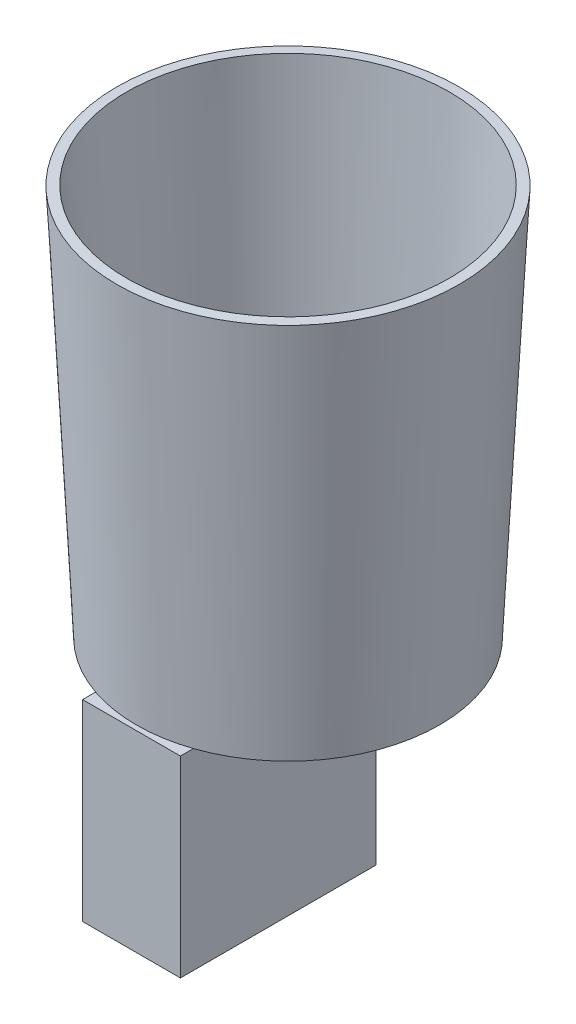
ISO-10303-21;
HEADER;
FILE_DESCRIPTION(('STEP AP214'),'2;1');
FILE_NAME('part.step','',(''),(''),'','','');
FILE_SCHEMA(('AUTOMOTIVE_DESIGN { 1 0 10303 214 1 1 1 1 }'));
ENDSEC;
DATA;
#1=APPLICATION_CONTEXT('core data for automotive mechanical design processes');
#2=APPLICATION_PROTOCOL_DEFINITION('international standard','automotive_design',2000,#1);
#3=PRODUCT_CONTEXT('',#1,'mechanical');
#4=PRODUCT('Part','Part','',(#3));
#5=PRODUCT_RELATED_PRODUCT_CATEGORY('part','',(#4));
#6=PRODUCT_DEFINITION_FORMATION('','',#4);
#7=PRODUCT_DEFINITION_CONTEXT('part definition',#1,'design');
#8=PRODUCT_DEFINITION('design','',#6,#7);
#9=PRODUCT_DEFINITION_SHAPE('','',#8);
#10=(LENGTH_UNIT() NAMED_UNIT(*) SI_UNIT(.MILLI.,.METRE.));
#11=(NAMED_UNIT(*) PLANE_ANGLE_UNIT() SI_UNIT($,.RADIAN.));
#12=(NAMED_UNIT(*) SI_UNIT($,.STERADIAN.) SOLID_ANGLE_UNIT());
#13=UNCERTAINTY_MEASURE_WITH_UNIT(LENGTH_MEASURE(1.E-05),#10,'distance_accuracy_value','');
#14=(GEOMETRIC_REPRESENTATION_CONTEXT(3) GLOBAL_UNCERTAINTY_ASSIGNED_CONTEXT((#13)) GLOBAL_UNIT_ASSIGNED_CONTEXT((#10,
#11,#12)) REPRESENTATION_CONTEXT('',''));
#15=CARTESIAN_POINT('',(0.,0.,0.));
#16=DIRECTION('',(0.,0.,1.));
#17=DIRECTION('',(1.,0.,0.));
#18=AXIS2_PLACEMENT_3D('',#15,#16,#17);
#19=CARTESIAN_POINT('',(0.,2.,0.));
#20=DIRECTION('',(0.,-1.,0.));
#21=DIRECTION('',(0.,0.,-1.));
#22=AXIS2_PLACEMENT_3D('',#19,#20,#21);
#23=PLANE('',#22);
#24=CARTESIAN_POINT('',(0.,2.,0.));
#25=DIRECTION('',(0.,-1.,0.));
#26=DIRECTION('',(0.,0.,-1.));
#27=AXIS2_PLACEMENT_3D('',#24,#25,#26);
#28=CIRCLE('',#27,29.0975015605499);
#29=CARTESIAN_POINT('',(-28.4449188535207,2.,-6.12790245376245));
#30=VERTEX_POINT('',#29);
#31=CARTESIAN_POINT('',(-28.4449188535208,2.,6.12790245376369));
#32=VERTEX_POINT('',#31);
#33=EDGE_CURVE('E200',#30,#32,#28,.T.);
#34=ORIENTED_EDGE('',*,*,#33,.F.);
#35=CARTESIAN_POINT('',(-17.5500204365013,2.,0.));
#36=DIRECTION('',(0.,-1.,0.));
#37=DIRECTION('',(0.,0.,-1.));
#38=AXIS2_PLACEMENT_3D('',#35,#36,#37);
#39=CIRCLE('',#38,12.5);
#40=EDGE_CURVE('E163',#30,#32,#39,.T.);
#41=ORIENTED_EDGE('',*,*,#40,.T.);
#42=EDGE_LOOP('',(#34,#41));
#43=FACE_BOUND('',#42,.T.);
#44=ADVANCED_FACE('F45',(#43),#23,.F.);
#45=CARTESIAN_POINT('',(0.,2.,0.));
#46=DIRECTION('',(0.,1.,0.));
#47=DIRECTION('',(0.,0.,1.));
#48=AXIS2_PLACEMENT_3D('',#45,#46,#47);
#49=CONICAL_SURFACE('',#48,29.0975015605499,0.049958395721943);
#50=CARTESIAN_POINT('',(0.,80.0998752338878,0.));
#51=DIRECTION('',(0.,-1.,0.));
#52=DIRECTION('',(0.,0.,-1.));
#53=AXIS2_PLACEMENT_3D('',#50,#51,#52);
#54=CIRCLE('',#53,33.0024953222443);
#55=CARTESIAN_POINT('',(0.,80.0998752338878,-33.0024953222443));
#56=VERTEX_POINT('',#55);
#57=EDGE_CURVE('E197',#56,#56,#54,.T.);
#58=ORIENTED_EDGE('',*,*,#57,.F.);
#59=EDGE_LOOP('',(#58));
#60=FACE_BOUND('',#59,.T.);
#61=CARTESIAN_POINT('',(0.,10.,0.));
#62=DIRECTION('',(0.,-1.,0.));
#63=DIRECTION('',(0.,0.,-1.));
#64=AXIS2_PLACEMENT_3D('',#61,#62,#63);
#65=CIRCLE('',#64,29.4975015605499);
#66=CARTESIAN_POINT('',(-29.1126673992629,10.,-4.74923101296821));
#67=VERTEX_POINT('',#66);
#68=CARTESIAN_POINT('',(-29.1126673992629,10.,4.74923101296821));
#69=VERTEX_POINT('',#68);
#70=EDGE_CURVE('E48',#67,#69,#65,.F.);
#71=ORIENTED_EDGE('',*,*,#70,.F.);
#72=CARTESIAN_POINT('',(-29.1126842069394,10.0002,-4.74919009219443));
#73=CARTESIAN_POINT('',(-29.0848271125376,9.66871953200251,-4.8170018045622));
#74=CARTESIAN_POINT('',(-29.0569653201843,9.33690360468931,-4.88314971751414));
#75=CARTESIAN_POINT('',(-29.0012402368718,8.67269211240039,-5.0124389133255));
#76=CARTESIAN_POINT('',(-28.9733769459468,8.34029655752854,-5.07558024806213));
#77=CARTESIAN_POINT('',(-28.8898056206265,7.34248426926094,-5.26095618551299));
#78=CARTESIAN_POINT('',(-28.8341057369354,6.67631819992975,-5.37916777602019));
#79=CARTESIAN_POINT('',(-28.7227719039152,5.34249816552135,-5.60675423269039));
#80=CARTESIAN_POINT('',(-28.6671379534014,4.67484422781767,-5.7161292600699));
#81=CARTESIAN_POINT('',(-28.5559506185028,3.33821104693318,-5.92735649125253));
#82=CARTESIAN_POINT('',(-28.5003972508806,2.66923158191331,-6.02920730303987));
#83=CARTESIAN_POINT('',(-28.4449022737699,1.99979999999999,-6.12793193108039));
#84=B_SPLINE_CURVE_WITH_KNOTS('',3,(#72,#73,#74,#75,#76,#77,#78,#79,#80,#81,#82,#83),
.UNSPECIFIED.,.F.,.F.,(4,2,2,2,2,4),(0.,1.01846005508213,2.03690253070187,4.07340757726233,
6.10987546090858,8.14671916218802),.UNSPECIFIED.);
#85=EDGE_CURVE('E180',#67,#30,#84,.T.);
#86=ORIENTED_EDGE('',*,*,#85,.T.);
#87=ORIENTED_EDGE('',*,*,#33,.T.);
#88=CARTESIAN_POINT('',(-28.4449022737699,1.9998,6.12793193108039));
#89=CARTESIAN_POINT('',(-28.5003972508806,2.66923158191331,6.02920730303988));
#90=CARTESIAN_POINT('',(-28.5559506185028,3.33821104693318,5.92735649125254));
#91=CARTESIAN_POINT('',(-28.6671379534014,4.67484422781767,5.71612926006991));
#92=CARTESIAN_POINT('',(-28.7227719039152,5.34249816552135,5.60675423269039));
#93=CARTESIAN_POINT('',(-28.8341057369354,6.67631819992975,5.37916777602019));
#94=CARTESIAN_POINT('',(-28.8898056206265,7.34248426926094,5.26095618551299));
#95=CARTESIAN_POINT('',(-28.9733769459468,8.34029655752854,5.07558024806213));
#96=CARTESIAN_POINT('',(-29.0012402368718,8.67269211240038,5.0124389133255));
#97=CARTESIAN_POINT('',(-29.0569653201843,9.33690360468931,4.88314971751415));
#98=CARTESIAN_POINT('',(-29.0848271125376,9.66871953200251,4.81700180456222));
#99=CARTESIAN_POINT('',(-29.1126842069394,10.0002,4.74919009219446));
#100=B_SPLINE_CURVE_WITH_KNOTS('',3,(#88,#89,#90,#91,#92,#93,#94,#95,#96,#97,#98,#99),
.UNSPECIFIED.,.F.,.F.,(4,2,2,2,2,4),(0.,2.03684370127944,4.07331158492568,6.10981663148615,
7.12825910710588,8.14671916218801),.UNSPECIFIED.);
#101=EDGE_CURVE('E152',#32,#69,#100,.T.);
#102=ORIENTED_EDGE('',*,*,#101,.T.);
#103=EDGE_LOOP('',(#71,#86,#87,#102));
#104=FACE_BOUND('',#103,.T.);
#105=ADVANCED_FACE('F165',(#60,#104),#49,.F.);
#106=CARTESIAN_POINT('',(0.,80.0998752338878,0.));
#107=DIRECTION('',(0.,-1.,0.));
#108=DIRECTION('',(0.,0.,-1.));
#109=AXIS2_PLACEMENT_3D('',#106,#107,#108);
#110=CONICAL_SURFACE('',#109,33.0024953222443,1.52083793107295);
#111=CARTESIAN_POINT('',(0.,80.,0.));
#112=DIRECTION('',(0.,-1.,0.));
#113=DIRECTION('',(0.,0.,-1.));
#114=AXIS2_PLACEMENT_3D('',#111,#112,#113);
#115=CIRCLE('',#114,35.);
#116=CARTESIAN_POINT('',(0.,80.,-35.));
#117=VERTEX_POINT('',#116);
#118=EDGE_CURVE('E193',#117,#117,#115,.T.);
#119=ORIENTED_EDGE('',*,*,#118,.F.);
#120=EDGE_LOOP('',(#119));
#121=FACE_BOUND('',#120,.T.);
#122=ORIENTED_EDGE('',*,*,#57,.T.);
#123=EDGE_LOOP('',(#122));
#124=FACE_BOUND('',#123,.T.);
#125=ADVANCED_FACE('F259',(#121,#124),#110,.T.);
#126=CARTESIAN_POINT('',(0.,80.,0.));
#127=DIRECTION('',(0.,1.,0.));
#128=DIRECTION('',(0.,0.,1.));
#129=AXIS2_PLACEMENT_3D('',#126,#127,#128);
#130=CONICAL_SURFACE('',#129,35.,0.0499583957219429);
#131=CARTESIAN_POINT('',(0.,0.,0.));
#132=DIRECTION('',(0.,-1.,0.));
#133=DIRECTION('',(0.,0.,-1.));
#134=AXIS2_PLACEMENT_3D('',#131,#132,#133);
#135=CIRCLE('',#134,31.);
#136=CARTESIAN_POINT('',(10.,0.,29.3428015022424));
#137=VERTEX_POINT('',#136);
#138=CARTESIAN_POINT('',(-10.,0.,29.3428015022424));
#139=VERTEX_POINT('',#138);
#140=EDGE_CURVE('E189',#137,#139,#135,.T.);
#141=ORIENTED_EDGE('',*,*,#140,.F.);
#142=EDGE_CURVE('E188',#139,#137,#135,.T.);
#143=ORIENTED_EDGE('',*,*,#142,.F.);
#144=EDGE_LOOP('',(#141,#143));
#145=FACE_BOUND('',#144,.T.);
#146=ORIENTED_EDGE('',*,*,#118,.T.);
#147=EDGE_LOOP('',(#146));
#148=FACE_BOUND('',#147,.T.);
#149=ADVANCED_FACE('F268',(#145,#148),#130,.T.);
#150=CARTESIAN_POINT('',(0.,0.,0.));
#151=DIRECTION('',(0.,1.,0.));
#152=DIRECTION('',(0.,0.,1.));
#153=AXIS2_PLACEMENT_3D('',#150,#151,#152);
#154=PLANE('',#153);
#155=DIRECTION('',(0.,0.,1.));
#156=VECTOR('',#155,1.);
#157=CARTESIAN_POINT('',(10.,0.,32.));
#158=LINE('',#157,#156);
#159=CARTESIAN_POINT('',(10.,0.,-8.));
#160=VERTEX_POINT('',#159);
#161=EDGE_CURVE('E63',#160,#137,#158,.T.);
#162=ORIENTED_EDGE('',*,*,#161,.F.);
#163=DIRECTION('',(1.,0.,0.));
#164=VECTOR('',#163,1.);
#165=CARTESIAN_POINT('',(10.,0.,-8.));
#166=LINE('',#165,#164);
#167=CARTESIAN_POINT('',(-7.94533408035201,0.,-8.));
#168=VERTEX_POINT('',#167);
#169=EDGE_CURVE('E11',#168,#160,#166,.T.);
#170=ORIENTED_EDGE('',*,*,#169,.F.);
#171=CARTESIAN_POINT('',(-17.5500204365013,0.,0.));
#172=DIRECTION('',(0.,-1.,0.));
#173=DIRECTION('',(0.,0.,-1.));
#174=AXIS2_PLACEMENT_3D('',#171,#172,#173);
#175=CIRCLE('',#174,12.5);
#176=CARTESIAN_POINT('',(-10.,0.,9.96228846241731));
#177=VERTEX_POINT('',#176);
#178=EDGE_CURVE('E139',#177,#168,#175,.T.);
#179=ORIENTED_EDGE('',*,*,#178,.F.);
#180=DIRECTION('',(0.,0.,-1.));
#181=VECTOR('',#180,1.);
#182=CARTESIAN_POINT('',(-10.,0.,32.));
#183=LINE('',#182,#181);
#184=EDGE_CURVE('E54',#139,#177,#183,.T.);
#185=ORIENTED_EDGE('',*,*,#184,.F.);
#186=ORIENTED_EDGE('',*,*,#142,.T.);
#187=EDGE_LOOP('',(#162,#170,#179,#185,#186));
#188=FACE_BOUND('',#187,.T.);
#189=ADVANCED_FACE('F177',(#188),#154,.F.);
#190=CARTESIAN_POINT('',(-17.5500204365013,10.,0.));
#191=DIRECTION('',(0.,-1.,0.));
#192=DIRECTION('',(0.,0.,-1.));
#193=AXIS2_PLACEMENT_3D('',#190,#191,#192);
#194=PLANE('',#193);
#195=ORIENTED_EDGE('',*,*,#70,.T.);
#196=CARTESIAN_POINT('',(-17.5500204365013,10.,0.));
#197=DIRECTION('',(0.,-1.,0.));
#198=DIRECTION('',(0.,0.,-1.));
#199=AXIS2_PLACEMENT_3D('',#196,#197,#198);
#200=CIRCLE('',#199,12.5);
#201=EDGE_CURVE('E150',#69,#67,#200,.T.);
#202=ORIENTED_EDGE('',*,*,#201,.T.);
#203=EDGE_LOOP('',(#195,#202));
#204=FACE_BOUND('',#203,.T.);
#205=ADVANCED_FACE('F174',(#204),#194,.T.);
#206=CARTESIAN_POINT('',(-17.5500204365013,10.,0.));
#207=DIRECTION('',(0.,-1.,0.));
#208=DIRECTION('',(0.,0.,-1.));
#209=AXIS2_PLACEMENT_3D('',#206,#207,#208);
#210=CYLINDRICAL_SURFACE('',#209,12.5);
#211=EDGE_CURVE('E144',#168,#177,#175,.T.);
#212=ORIENTED_EDGE('',*,*,#211,.T.);
#213=ORIENTED_EDGE('',*,*,#178,.T.);
#214=EDGE_LOOP('',(#212,#213));
#215=FACE_BOUND('',#214,.T.);
#216=ORIENTED_EDGE('',*,*,#201,.F.);
#217=ORIENTED_EDGE('',*,*,#101,.F.);
#218=ORIENTED_EDGE('',*,*,#40,.F.);
#219=ORIENTED_EDGE('',*,*,#85,.F.);
#220=EDGE_LOOP('',(#216,#217,#218,#219));
#221=FACE_BOUND('',#220,.T.);
#222=ADVANCED_FACE('F168',(#215,#221),#210,.F.);
#223=CARTESIAN_POINT('',(0.,0.,0.));
#224=DIRECTION('',(0.,1.,0.));
#225=DIRECTION('',(0.,0.,1.));
#226=AXIS2_PLACEMENT_3D('',#223,#224,#225);
#227=PLANE('',#226);
#228=ORIENTED_EDGE('',*,*,#211,.F.);
#229=CARTESIAN_POINT('',(-10.,0.,-8.));
#230=VERTEX_POINT('',#229);
#231=EDGE_CURVE('E56',#230,#168,#166,.T.);
#232=ORIENTED_EDGE('',*,*,#231,.F.);
#233=EDGE_CURVE('E212',#177,#230,#183,.T.);
#234=ORIENTED_EDGE('',*,*,#233,.F.);
#235=EDGE_LOOP('',(#228,#232,#234));
#236=FACE_BOUND('',#235,.T.);
#237=ADVANCED_FACE('F173',(#236),#227,.T.);
#238=CARTESIAN_POINT('',(0.,-39.3,0.));
#239=DIRECTION('',(0.,1.,0.));
#240=DIRECTION('',(0.,0.,1.));
#241=AXIS2_PLACEMENT_3D('',#238,#239,#240);
#242=PLANE('',#241);
#243=DIRECTION('',(0.,0.,1.));
#244=VECTOR('',#243,1.);
#245=CARTESIAN_POINT('',(10.,-39.3,32.));
#246=LINE('',#245,#244);
#247=CARTESIAN_POINT('',(10.,-39.3,-8.));
#248=VERTEX_POINT('',#247);
#249=CARTESIAN_POINT('',(10.,-39.3,32.));
#250=VERTEX_POINT('',#249);
#251=EDGE_CURVE('E122',#248,#250,#246,.T.);
#252=ORIENTED_EDGE('',*,*,#251,.T.);
#253=DIRECTION('',(-1.,0.,0.));
#254=VECTOR('',#253,1.);
#255=CARTESIAN_POINT('',(10.,-39.3,32.));
#256=LINE('',#255,#254);
#257=CARTESIAN_POINT('',(-10.,-39.3,32.));
#258=VERTEX_POINT('',#257);
#259=EDGE_CURVE('E111',#250,#258,#256,.T.);
#260=ORIENTED_EDGE('',*,*,#259,.T.);
#261=DIRECTION('',(0.,0.,-1.));
#262=VECTOR('',#261,1.);
#263=CARTESIAN_POINT('',(-10.,-39.3,32.));
#264=LINE('',#263,#262);
#265=CARTESIAN_POINT('',(-10.,-39.3,-8.));
#266=VERTEX_POINT('',#265);
#267=EDGE_CURVE('E121',#258,#266,#264,.T.);
#268=ORIENTED_EDGE('',*,*,#267,.T.);
#269=DIRECTION('',(1.,0.,0.));
#270=VECTOR('',#269,1.);
#271=CARTESIAN_POINT('',(10.,-39.3,-8.));
#272=LINE('',#271,#270);
#273=EDGE_CURVE('E128',#266,#248,#272,.T.);
#274=ORIENTED_EDGE('',*,*,#273,.T.);
#275=EDGE_LOOP('',(#252,#260,#268,#274));
#276=FACE_BOUND('',#275,.T.);
#277=CARTESIAN_POINT('',(0.,-39.3,0.));
#278=DIRECTION('',(0.,-1.,0.));
#279=DIRECTION('',(0.,0.,-1.));
#280=AXIS2_PLACEMENT_3D('',#277,#278,#279);
#281=CIRCLE('',#280,3.53748213692294);
#282=CARTESIAN_POINT('',(0.,-39.3,-3.53748213692294));
#283=VERTEX_POINT('',#282);
#284=EDGE_CURVE('E235',#283,#283,#281,.T.);
#285=ORIENTED_EDGE('',*,*,#284,.F.);
#286=EDGE_LOOP('',(#285));
#287=FACE_BOUND('',#286,.T.);
#288=ADVANCED_FACE('F125',(#276,#287),#242,.F.);
#289=CARTESIAN_POINT('',(10.,0.,32.));
#290=VERTEX_POINT('',#289);
#291=EDGE_CURVE('E136',#137,#290,#158,.T.);
#292=ORIENTED_EDGE('',*,*,#291,.F.);
#293=ORIENTED_EDGE('',*,*,#140,.T.);
#294=CARTESIAN_POINT('',(-10.,0.,32.));
#295=VERTEX_POINT('',#294);
#296=EDGE_CURVE('E211',#295,#139,#183,.T.);
#297=ORIENTED_EDGE('',*,*,#296,.F.);
#298=DIRECTION('',(-1.,0.,0.));
#299=VECTOR('',#298,1.);
#300=CARTESIAN_POINT('',(10.,0.,32.));
#301=LINE('',#300,#299);
#302=EDGE_CURVE('E218',#290,#295,#301,.T.);
#303=ORIENTED_EDGE('',*,*,#302,.F.);
#304=EDGE_LOOP('',(#292,#293,#297,#303));
#305=FACE_BOUND('',#304,.T.);
#306=ADVANCED_FACE('F244',(#305),#227,.T.);
#307=CARTESIAN_POINT('',(10.,-39.3,32.));
#308=DIRECTION('',(-1.,0.,0.));
#309=DIRECTION('',(0.,0.,1.));
#310=AXIS2_PLACEMENT_3D('',#307,#308,#309);
#311=PLANE('',#310);
#312=ORIENTED_EDGE('',*,*,#161,.T.);
#313=ORIENTED_EDGE('',*,*,#291,.T.);
#314=DIRECTION('',(0.,1.,0.));
#315=VECTOR('',#314,1.);
#316=CARTESIAN_POINT('',(10.,-39.3,32.));
#317=LINE('',#316,#315);
#318=EDGE_CURVE('E115',#250,#290,#317,.T.);
#319=ORIENTED_EDGE('',*,*,#318,.F.);
#320=ORIENTED_EDGE('',*,*,#251,.F.);
#321=DIRECTION('',(0.,1.,0.));
#322=VECTOR('',#321,1.);
#323=CARTESIAN_POINT('',(10.,-39.3,-8.));
#324=LINE('',#323,#322);
#325=EDGE_CURVE('E228',#248,#160,#324,.T.);
#326=ORIENTED_EDGE('',*,*,#325,.T.);
#327=EDGE_LOOP('',(#312,#313,#319,#320,#326));
#328=FACE_BOUND('',#327,.T.);
#329=ADVANCED_FACE('F134',(#328),#311,.F.);
#330=CARTESIAN_POINT('',(10.,-39.3,32.));
#331=DIRECTION('',(0.,0.,-1.));
#332=DIRECTION('',(-1.,0.,0.));
#333=AXIS2_PLACEMENT_3D('',#330,#331,#332);
#334=PLANE('',#333);
#335=ORIENTED_EDGE('',*,*,#302,.T.);
#336=DIRECTION('',(0.,1.,0.));
#337=VECTOR('',#336,1.);
#338=CARTESIAN_POINT('',(-10.,-39.3,32.));
#339=LINE('',#338,#337);
#340=EDGE_CURVE('E117',#258,#295,#339,.T.);
#341=ORIENTED_EDGE('',*,*,#340,.F.);
#342=ORIENTED_EDGE('',*,*,#259,.F.);
#343=ORIENTED_EDGE('',*,*,#318,.T.);
#344=EDGE_LOOP('',(#335,#341,#342,#343));
#345=FACE_BOUND('',#344,.T.);
#346=ADVANCED_FACE('F113',(#345),#334,.F.);
#347=CARTESIAN_POINT('',(-10.,-39.3,32.));
#348=DIRECTION('',(1.,0.,0.));
#349=DIRECTION('',(0.,0.,-1.));
#350=AXIS2_PLACEMENT_3D('',#347,#348,#349);
#351=PLANE('',#350);
#352=ORIENTED_EDGE('',*,*,#296,.T.);
#353=ORIENTED_EDGE('',*,*,#184,.T.);
#354=ORIENTED_EDGE('',*,*,#233,.T.);
#355=DIRECTION('',(0.,1.,0.));
#356=VECTOR('',#355,1.);
#357=CARTESIAN_POINT('',(-10.,-39.3,-8.));
#358=LINE('',#357,#356);
#359=EDGE_CURVE('E146',#266,#230,#358,.T.);
#360=ORIENTED_EDGE('',*,*,#359,.F.);
#361=ORIENTED_EDGE('',*,*,#267,.F.);
#362=ORIENTED_EDGE('',*,*,#340,.T.);
#363=EDGE_LOOP('',(#352,#353,#354,#360,#361,#362));
#364=FACE_BOUND('',#363,.T.);
#365=ADVANCED_FACE('F297',(#364),#351,.F.);
#366=CARTESIAN_POINT('',(10.,-39.3,-8.));
#367=DIRECTION('',(0.,0.,1.));
#368=DIRECTION('',(1.,0.,0.));
#369=AXIS2_PLACEMENT_3D('',#366,#367,#368);
#370=PLANE('',#369);
#371=ORIENTED_EDGE('',*,*,#231,.T.);
#372=ORIENTED_EDGE('',*,*,#169,.T.);
#373=ORIENTED_EDGE('',*,*,#325,.F.);
#374=ORIENTED_EDGE('',*,*,#273,.F.);
#375=ORIENTED_EDGE('',*,*,#359,.T.);
#376=EDGE_LOOP('',(#371,#372,#373,#374,#375));
#377=FACE_BOUND('',#376,.T.);
#378=ADVANCED_FACE('F278',(#377),#370,.F.);
#379=CARTESIAN_POINT('',(0.,-39.3,0.));
#380=DIRECTION('',(0.,1.,0.));
#381=DIRECTION('',(0.,0.,1.));
#382=AXIS2_PLACEMENT_3D('',#379,#380,#381);
#383=CYLINDRICAL_SURFACE('',#382,3.53748213692294);
#384=ORIENTED_EDGE('',*,*,#284,.T.);
#385=EDGE_LOOP('',(#384));
#386=FACE_BOUND('',#385,.T.);
#387=CARTESIAN_POINT('',(0.,0.,0.));
#388=DIRECTION('',(0.,-1.,0.));
#389=DIRECTION('',(0.,0.,-1.));
#390=AXIS2_PLACEMENT_3D('',#387,#388,#389);
#391=CIRCLE('',#390,3.53748213692294);
#392=CARTESIAN_POINT('',(0.,0.,-3.53748213692294));
#393=VERTEX_POINT('',#392);
#394=EDGE_CURVE('E231',#393,#393,#391,.T.);
#395=ORIENTED_EDGE('',*,*,#394,.F.);
#396=EDGE_LOOP('',(#395));
#397=FACE_BOUND('',#396,.T.);
#398=ADVANCED_FACE('F241',(#386,#397),#383,.F.);
#399=ORIENTED_EDGE('',*,*,#394,.T.);
#400=EDGE_LOOP('',(#399));
#401=FACE_BOUND('',#400,.T.);
#402=ADVANCED_FACE('F284',(#401),#154,.F.);
#403=CLOSED_SHELL('',(#44,#105,#125,#149,#189,#205,#222,#237,#288,#306,#329,#346,#365,#378,#398,#402));
#404=MANIFOLD_SOLID_BREP('B2',#403);
#405=ADVANCED_BREP_SHAPE_REPRESENTATION('',(#18,#404),#14);
#406=SHAPE_DEFINITION_REPRESENTATION(#9,#405);
ENDSEC;
END-ISO-10303-21;
